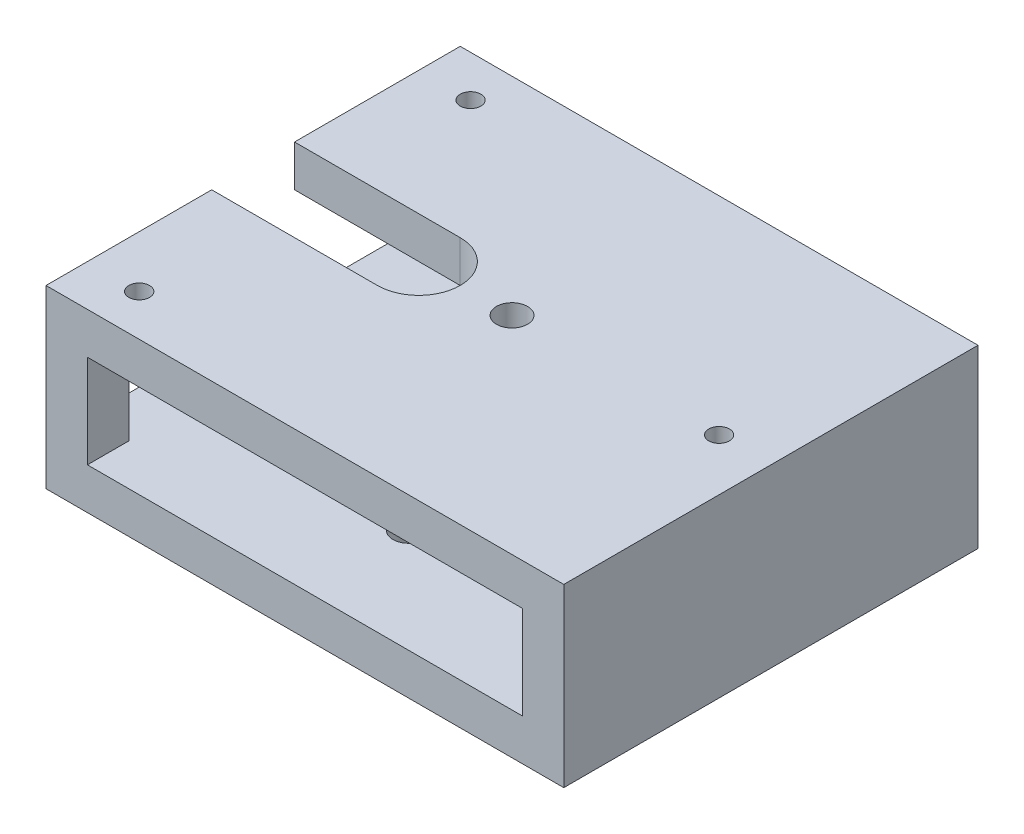
ISO-10303-21;
HEADER;
FILE_DESCRIPTION(('STEP AP214'),'2;1');
FILE_NAME('part.step','',(''),(''),'','','');
FILE_SCHEMA(('AUTOMOTIVE_DESIGN { 1 0 10303 214 1 1 1 1 }'));
ENDSEC;
DATA;
#1=APPLICATION_CONTEXT('core data for automotive mechanical design processes');
#2=APPLICATION_PROTOCOL_DEFINITION('international standard','automotive_design',2000,#1);
#3=PRODUCT_CONTEXT('',#1,'mechanical');
#4=PRODUCT('Part','Part','',(#3));
#5=PRODUCT_RELATED_PRODUCT_CATEGORY('part','',(#4));
#6=PRODUCT_DEFINITION_FORMATION('','',#4);
#7=PRODUCT_DEFINITION_CONTEXT('part definition',#1,'design');
#8=PRODUCT_DEFINITION('design','',#6,#7);
#9=PRODUCT_DEFINITION_SHAPE('','',#8);
#10=(LENGTH_UNIT() NAMED_UNIT(*) SI_UNIT(.MILLI.,.METRE.));
#11=(NAMED_UNIT(*) PLANE_ANGLE_UNIT() SI_UNIT($,.RADIAN.));
#12=(NAMED_UNIT(*) SI_UNIT($,.STERADIAN.) SOLID_ANGLE_UNIT());
#13=UNCERTAINTY_MEASURE_WITH_UNIT(LENGTH_MEASURE(1.E-05),#10,'distance_accuracy_value','');
#14=(GEOMETRIC_REPRESENTATION_CONTEXT(3) GLOBAL_UNCERTAINTY_ASSIGNED_CONTEXT((#13)) GLOBAL_UNIT_ASSIGNED_CONTEXT((#10,
#11,#12)) REPRESENTATION_CONTEXT('',''));
#15=CARTESIAN_POINT('',(0.,0.,0.));
#16=DIRECTION('',(0.,0.,1.));
#17=DIRECTION('',(1.,0.,0.));
#18=AXIS2_PLACEMENT_3D('',#15,#16,#17);
#19=CARTESIAN_POINT('',(-125.,20.,-100.));
#20=DIRECTION('',(1.,0.,0.));
#21=DIRECTION('',(0.,0.,-1.));
#22=AXIS2_PLACEMENT_3D('',#19,#20,#21);
#23=PLANE('',#22);
#24=DIRECTION('',(0.,0.,1.));
#25=VECTOR('',#24,1.);
#26=CARTESIAN_POINT('',(-125.,0.,-100.));
#27=LINE('',#26,#25);
#28=CARTESIAN_POINT('',(-125.,0.,-100.));
#29=VERTEX_POINT('',#28);
#30=CARTESIAN_POINT('',(-125.,0.,-20.));
#31=VERTEX_POINT('',#30);
#32=EDGE_CURVE('E328',#29,#31,#27,.T.);
#33=ORIENTED_EDGE('',*,*,#32,.T.);
#34=DIRECTION('',(0.,1.,0.));
#35=VECTOR('',#34,1.);
#36=CARTESIAN_POINT('',(-125.,0.,-20.));
#37=LINE('',#36,#35);
#38=CARTESIAN_POINT('',(-125.,20.,-20.));
#39=VERTEX_POINT('',#38);
#40=EDGE_CURVE('E365',#31,#39,#37,.T.);
#41=ORIENTED_EDGE('',*,*,#40,.T.);
#42=DIRECTION('',(0.,0.,1.));
#43=VECTOR('',#42,1.);
#44=CARTESIAN_POINT('',(-125.,20.,-100.));
#45=LINE('',#44,#43);
#46=CARTESIAN_POINT('',(-125.,20.,-80.));
#47=VERTEX_POINT('',#46);
#48=EDGE_CURVE('E318',#47,#39,#45,.T.);
#49=ORIENTED_EDGE('',*,*,#48,.F.);
#50=DIRECTION('',(0.,-1.,0.));
#51=VECTOR('',#50,1.);
#52=CARTESIAN_POINT('',(-125.,65.,-80.));
#53=LINE('',#52,#51);
#54=CARTESIAN_POINT('',(-125.,65.,-80.));
#55=VERTEX_POINT('',#54);
#56=EDGE_CURVE('E267',#55,#47,#53,.T.);
#57=ORIENTED_EDGE('',*,*,#56,.F.);
#58=DIRECTION('',(0.,0.,1.));
#59=VECTOR('',#58,1.);
#60=CARTESIAN_POINT('',(-125.,65.,-100.));
#61=LINE('',#60,#59);
#62=CARTESIAN_POINT('',(-125.,65.,-20.));
#63=VERTEX_POINT('',#62);
#64=EDGE_CURVE('E288',#55,#63,#61,.T.);
#65=ORIENTED_EDGE('',*,*,#64,.T.);
#66=CARTESIAN_POINT('',(-125.,85.,-20.));
#67=VERTEX_POINT('',#66);
#68=EDGE_CURVE('E360',#63,#67,#37,.T.);
#69=ORIENTED_EDGE('',*,*,#68,.T.);
#70=DIRECTION('',(0.,0.,1.));
#71=VECTOR('',#70,1.);
#72=CARTESIAN_POINT('',(-125.,85.,-100.));
#73=LINE('',#72,#71);
#74=CARTESIAN_POINT('',(-125.,85.,-100.));
#75=VERTEX_POINT('',#74);
#76=EDGE_CURVE('E279',#75,#67,#73,.T.);
#77=ORIENTED_EDGE('',*,*,#76,.F.);
#78=DIRECTION('',(0.,-1.,0.));
#79=VECTOR('',#78,1.);
#80=CARTESIAN_POINT('',(-125.,20.,-100.));
#81=LINE('',#80,#79);
#82=EDGE_CURVE('E337',#75,#29,#81,.T.);
#83=ORIENTED_EDGE('',*,*,#82,.T.);
#84=EDGE_LOOP('',(#33,#41,#49,#57,#65,#69,#77,#83));
#85=FACE_BOUND('',#84,.T.);
#86=ADVANCED_FACE('F38',(#85),#23,.F.);
#87=CARTESIAN_POINT('',(0.,20.,0.));
#88=DIRECTION('',(0.,1.,0.));
#89=DIRECTION('',(0.,0.,1.));
#90=AXIS2_PLACEMENT_3D('',#87,#88,#89);
#91=PLANE('',#90);
#92=DIRECTION('',(0.,0.,-1.));
#93=VECTOR('',#92,1.);
#94=CARTESIAN_POINT('',(120.,20.,80.));
#95=LINE('',#94,#93);
#96=CARTESIAN_POINT('',(120.,20.,80.));
#97=VERTEX_POINT('',#96);
#98=CARTESIAN_POINT('',(120.,20.,-80.));
#99=VERTEX_POINT('',#98);
#100=EDGE_CURVE('E53',#97,#99,#95,.T.);
#101=ORIENTED_EDGE('',*,*,#100,.T.);
#102=DIRECTION('',(1.,0.,0.));
#103=VECTOR('',#102,1.);
#104=CARTESIAN_POINT('',(125.,20.,-80.));
#105=LINE('',#104,#103);
#106=CARTESIAN_POINT('',(105.,20.,-80.));
#107=VERTEX_POINT('',#106);
#108=EDGE_CURVE('E231',#107,#99,#105,.T.);
#109=ORIENTED_EDGE('',*,*,#108,.F.);
#110=DIRECTION('',(0.,0.,1.));
#111=VECTOR('',#110,1.);
#112=CARTESIAN_POINT('',(105.,20.,-100.));
#113=LINE('',#112,#111);
#114=CARTESIAN_POINT('',(105.,20.,-100.));
#115=VERTEX_POINT('',#114);
#116=EDGE_CURVE('E227',#115,#107,#113,.T.);
#117=ORIENTED_EDGE('',*,*,#116,.F.);
#118=DIRECTION('',(-1.,0.,0.));
#119=VECTOR('',#118,1.);
#120=CARTESIAN_POINT('',(-125.,20.,-100.));
#121=LINE('',#120,#119);
#122=CARTESIAN_POINT('',(-105.,20.,-100.));
#123=VERTEX_POINT('',#122);
#124=EDGE_CURVE('E314',#115,#123,#121,.T.);
#125=ORIENTED_EDGE('',*,*,#124,.T.);
#126=DIRECTION('',(0.,0.,-1.));
#127=VECTOR('',#126,1.);
#128=CARTESIAN_POINT('',(-105.,20.,-100.));
#129=LINE('',#128,#127);
#130=CARTESIAN_POINT('',(-105.,20.,-80.));
#131=VERTEX_POINT('',#130);
#132=EDGE_CURVE('E254',#131,#123,#129,.T.);
#133=ORIENTED_EDGE('',*,*,#132,.F.);
#134=DIRECTION('',(1.,0.,0.));
#135=VECTOR('',#134,1.);
#136=CARTESIAN_POINT('',(-125.,20.,-80.));
#137=LINE('',#136,#135);
#138=EDGE_CURVE('E249',#47,#131,#137,.T.);
#139=ORIENTED_EDGE('',*,*,#138,.F.);
#140=ORIENTED_EDGE('',*,*,#48,.T.);
#141=DIRECTION('',(-1.,0.,0.));
#142=VECTOR('',#141,1.);
#143=CARTESIAN_POINT('',(0.,20.,-20.));
#144=LINE('',#143,#142);
#145=CARTESIAN_POINT('',(-45.0000000000001,20.,-20.));
#146=VERTEX_POINT('',#145);
#147=EDGE_CURVE('E395',#146,#39,#144,.T.);
#148=ORIENTED_EDGE('',*,*,#147,.F.);
#149=CARTESIAN_POINT('',(-45.0000000000001,20.,0.));
#150=DIRECTION('',(0.,1.,0.));
#151=DIRECTION('',(0.,0.,1.));
#152=AXIS2_PLACEMENT_3D('',#149,#150,#151);
#153=CIRCLE('',#152,20.);
#154=CARTESIAN_POINT('',(-45.,20.,20.));
#155=VERTEX_POINT('',#154);
#156=EDGE_CURVE('E391',#155,#146,#153,.T.);
#157=ORIENTED_EDGE('',*,*,#156,.F.);
#158=DIRECTION('',(1.,0.,0.));
#159=VECTOR('',#158,1.);
#160=CARTESIAN_POINT('',(0.,20.,20.));
#161=LINE('',#160,#159);
#162=CARTESIAN_POINT('',(-125.,20.,20.));
#163=VERTEX_POINT('',#162);
#164=EDGE_CURVE('E387',#163,#155,#161,.T.);
#165=ORIENTED_EDGE('',*,*,#164,.F.);
#166=CARTESIAN_POINT('',(-125.,20.,80.));
#167=VERTEX_POINT('',#166);
#168=EDGE_CURVE('E316',#163,#167,#45,.T.);
#169=ORIENTED_EDGE('',*,*,#168,.T.);
#170=DIRECTION('',(-1.,0.,0.));
#171=VECTOR('',#170,1.);
#172=CARTESIAN_POINT('',(-125.,20.,80.));
#173=LINE('',#172,#171);
#174=CARTESIAN_POINT('',(-105.,20.,80.));
#175=VERTEX_POINT('',#174);
#176=EDGE_CURVE('E297',#175,#167,#173,.T.);
#177=ORIENTED_EDGE('',*,*,#176,.F.);
#178=DIRECTION('',(0.,0.,-1.));
#179=VECTOR('',#178,1.);
#180=CARTESIAN_POINT('',(-105.,20.,100.));
#181=LINE('',#180,#179);
#182=CARTESIAN_POINT('',(-105.,20.,100.));
#183=VERTEX_POINT('',#182);
#184=EDGE_CURVE('E285',#183,#175,#181,.T.);
#185=ORIENTED_EDGE('',*,*,#184,.F.);
#186=DIRECTION('',(1.,0.,0.));
#187=VECTOR('',#186,1.);
#188=CARTESIAN_POINT('',(-125.,20.,100.));
#189=LINE('',#188,#187);
#190=CARTESIAN_POINT('',(105.,20.,100.));
#191=VERTEX_POINT('',#190);
#192=EDGE_CURVE('E219',#183,#191,#189,.T.);
#193=ORIENTED_EDGE('',*,*,#192,.T.);
#194=DIRECTION('',(0.,0.,1.));
#195=VECTOR('',#194,1.);
#196=CARTESIAN_POINT('',(105.,20.,100.));
#197=LINE('',#196,#195);
#198=CARTESIAN_POINT('',(105.,20.,80.));
#199=VERTEX_POINT('',#198);
#200=EDGE_CURVE('E212',#199,#191,#197,.T.);
#201=ORIENTED_EDGE('',*,*,#200,.F.);
#202=DIRECTION('',(-1.,0.,0.));
#203=VECTOR('',#202,1.);
#204=CARTESIAN_POINT('',(125.,20.,80.));
#205=LINE('',#204,#203);
#206=EDGE_CURVE('E203',#97,#199,#205,.T.);
#207=ORIENTED_EDGE('',*,*,#206,.F.);
#208=EDGE_LOOP('',(#101,#109,#117,#125,#133,#139,#140,#148,#157,#165,#169,#177,#185,#193,#201,#207));
#209=FACE_BOUND('',#208,.T.);
#210=CARTESIAN_POINT('',(0.,20.,50.));
#211=DIRECTION('',(0.,1.,0.));
#212=DIRECTION('',(0.,0.,1.));
#213=AXIS2_PLACEMENT_3D('',#210,#211,#212);
#214=CIRCLE('',#213,7.5);
#215=CARTESIAN_POINT('',(0.,20.,57.5));
#216=VERTEX_POINT('',#215);
#217=EDGE_CURVE('E451',#216,#216,#214,.F.);
#218=ORIENTED_EDGE('',*,*,#217,.T.);
#219=EDGE_LOOP('',(#218));
#220=FACE_BOUND('',#219,.T.);
#221=CARTESIAN_POINT('',(0.,20.,0.));
#222=DIRECTION('',(0.,1.,0.));
#223=DIRECTION('',(0.,0.,1.));
#224=AXIS2_PLACEMENT_3D('',#221,#222,#223);
#225=CIRCLE('',#224,7.5);
#226=CARTESIAN_POINT('',(0.,20.,7.5));
#227=VERTEX_POINT('',#226);
#228=EDGE_CURVE('E406',#227,#227,#225,.T.);
#229=ORIENTED_EDGE('',*,*,#228,.F.);
#230=EDGE_LOOP('',(#229));
#231=FACE_BOUND('',#230,.T.);
#232=ADVANCED_FACE('F216',(#209,#220,#231),#91,.T.);
#233=CARTESIAN_POINT('',(0.,65.,0.));
#234=DIRECTION('',(0.,1.,0.));
#235=DIRECTION('',(0.,0.,1.));
#236=AXIS2_PLACEMENT_3D('',#233,#234,#235);
#237=PLANE('',#236);
#238=CARTESIAN_POINT('',(0.,65.,0.));
#239=DIRECTION('',(0.,1.,0.));
#240=DIRECTION('',(0.,0.,1.));
#241=AXIS2_PLACEMENT_3D('',#238,#239,#240);
#242=CIRCLE('',#241,7.5);
#243=CARTESIAN_POINT('',(0.,65.,7.5));
#244=VERTEX_POINT('',#243);
#245=EDGE_CURVE('E401',#244,#244,#242,.T.);
#246=ORIENTED_EDGE('',*,*,#245,.T.);
#247=EDGE_LOOP('',(#246));
#248=FACE_BOUND('',#247,.T.);
#249=DIRECTION('',(1.,0.,0.));
#250=VECTOR('',#249,1.);
#251=CARTESIAN_POINT('',(125.,65.,-80.));
#252=LINE('',#251,#250);
#253=CARTESIAN_POINT('',(105.,65.,-80.));
#254=VERTEX_POINT('',#253);
#255=CARTESIAN_POINT('',(120.,65.,-80.));
#256=VERTEX_POINT('',#255);
#257=EDGE_CURVE('E238',#254,#256,#252,.T.);
#258=ORIENTED_EDGE('',*,*,#257,.T.);
#259=DIRECTION('',(0.,0.,1.));
#260=VECTOR('',#259,1.);
#261=CARTESIAN_POINT('',(120.,65.,80.));
#262=LINE('',#261,#260);
#263=CARTESIAN_POINT('',(120.,65.,80.));
#264=VERTEX_POINT('',#263);
#265=EDGE_CURVE('E464',#256,#264,#262,.T.);
#266=ORIENTED_EDGE('',*,*,#265,.T.);
#267=DIRECTION('',(-1.,0.,0.));
#268=VECTOR('',#267,1.);
#269=CARTESIAN_POINT('',(125.,65.,80.));
#270=LINE('',#269,#268);
#271=CARTESIAN_POINT('',(105.,65.,80.));
#272=VERTEX_POINT('',#271);
#273=EDGE_CURVE('E222',#264,#272,#270,.T.);
#274=ORIENTED_EDGE('',*,*,#273,.T.);
#275=DIRECTION('',(0.,0.,1.));
#276=VECTOR('',#275,1.);
#277=CARTESIAN_POINT('',(105.,65.,100.));
#278=LINE('',#277,#276);
#279=CARTESIAN_POINT('',(105.,65.,100.));
#280=VERTEX_POINT('',#279);
#281=EDGE_CURVE('E226',#272,#280,#278,.T.);
#282=ORIENTED_EDGE('',*,*,#281,.T.);
#283=DIRECTION('',(1.,0.,0.));
#284=VECTOR('',#283,1.);
#285=CARTESIAN_POINT('',(-125.,65.,100.));
#286=LINE('',#285,#284);
#287=CARTESIAN_POINT('',(-105.,65.,100.));
#288=VERTEX_POINT('',#287);
#289=EDGE_CURVE('E275',#288,#280,#286,.T.);
#290=ORIENTED_EDGE('',*,*,#289,.F.);
#291=DIRECTION('',(0.,0.,-1.));
#292=VECTOR('',#291,1.);
#293=CARTESIAN_POINT('',(-105.,65.,100.));
#294=LINE('',#293,#292);
#295=CARTESIAN_POINT('',(-105.,65.,80.));
#296=VERTEX_POINT('',#295);
#297=EDGE_CURVE('E293',#288,#296,#294,.T.);
#298=ORIENTED_EDGE('',*,*,#297,.T.);
#299=DIRECTION('',(-1.,0.,0.));
#300=VECTOR('',#299,1.);
#301=CARTESIAN_POINT('',(-125.,65.,80.));
#302=LINE('',#301,#300);
#303=CARTESIAN_POINT('',(-125.,65.,80.));
#304=VERTEX_POINT('',#303);
#305=EDGE_CURVE('E296',#296,#304,#302,.T.);
#306=ORIENTED_EDGE('',*,*,#305,.T.);
#307=CARTESIAN_POINT('',(-125.,65.,20.));
#308=VERTEX_POINT('',#307);
#309=EDGE_CURVE('E287',#308,#304,#61,.T.);
#310=ORIENTED_EDGE('',*,*,#309,.F.);
#311=DIRECTION('',(1.,0.,0.));
#312=VECTOR('',#311,1.);
#313=CARTESIAN_POINT('',(0.,65.,20.));
#314=LINE('',#313,#312);
#315=CARTESIAN_POINT('',(-45.,65.,20.));
#316=VERTEX_POINT('',#315);
#317=EDGE_CURVE('E369',#308,#316,#314,.T.);
#318=ORIENTED_EDGE('',*,*,#317,.T.);
#319=CARTESIAN_POINT('',(-45.0000000000001,65.,0.));
#320=DIRECTION('',(0.,1.,0.));
#321=DIRECTION('',(0.,0.,1.));
#322=AXIS2_PLACEMENT_3D('',#319,#320,#321);
#323=CIRCLE('',#322,20.);
#324=CARTESIAN_POINT('',(-45.0000000000001,65.,-20.));
#325=VERTEX_POINT('',#324);
#326=EDGE_CURVE('E389',#316,#325,#323,.T.);
#327=ORIENTED_EDGE('',*,*,#326,.T.);
#328=DIRECTION('',(-1.,0.,0.));
#329=VECTOR('',#328,1.);
#330=CARTESIAN_POINT('',(0.,65.,-20.));
#331=LINE('',#330,#329);
#332=EDGE_CURVE('E393',#325,#63,#331,.T.);
#333=ORIENTED_EDGE('',*,*,#332,.T.);
#334=ORIENTED_EDGE('',*,*,#64,.F.);
#335=DIRECTION('',(1.,0.,0.));
#336=VECTOR('',#335,1.);
#337=CARTESIAN_POINT('',(-125.,65.,-80.));
#338=LINE('',#337,#336);
#339=CARTESIAN_POINT('',(-105.,65.,-80.));
#340=VERTEX_POINT('',#339);
#341=EDGE_CURVE('E250',#55,#340,#338,.T.);
#342=ORIENTED_EDGE('',*,*,#341,.T.);
#343=DIRECTION('',(0.,0.,-1.));
#344=VECTOR('',#343,1.);
#345=CARTESIAN_POINT('',(-105.,65.,-100.));
#346=LINE('',#345,#344);
#347=CARTESIAN_POINT('',(-105.,65.,-100.));
#348=VERTEX_POINT('',#347);
#349=EDGE_CURVE('E253',#340,#348,#346,.T.);
#350=ORIENTED_EDGE('',*,*,#349,.T.);
#351=DIRECTION('',(-1.,0.,0.));
#352=VECTOR('',#351,1.);
#353=CARTESIAN_POINT('',(-125.,65.,-100.));
#354=LINE('',#353,#352);
#355=CARTESIAN_POINT('',(105.,65.,-100.));
#356=VERTEX_POINT('',#355);
#357=EDGE_CURVE('E270',#356,#348,#354,.T.);
#358=ORIENTED_EDGE('',*,*,#357,.F.);
#359=DIRECTION('',(0.,0.,1.));
#360=VECTOR('',#359,1.);
#361=CARTESIAN_POINT('',(105.,65.,-100.));
#362=LINE('',#361,#360);
#363=EDGE_CURVE('E235',#356,#254,#362,.T.);
#364=ORIENTED_EDGE('',*,*,#363,.T.);
#365=EDGE_LOOP('',(#258,#266,#274,#282,#290,#298,#306,#310,#318,#327,#333,#334,#342,#350,#358,#364));
#366=FACE_BOUND('',#365,.T.);
#367=ADVANCED_FACE('F429',(#248,#366),#237,.F.);
#368=CARTESIAN_POINT('',(125.,20.,-100.));
#369=DIRECTION('',(-1.,0.,0.));
#370=DIRECTION('',(0.,0.,1.));
#371=AXIS2_PLACEMENT_3D('',#368,#369,#370);
#372=PLANE('',#371);
#373=DIRECTION('',(0.,0.,-1.));
#374=VECTOR('',#373,1.);
#375=CARTESIAN_POINT('',(125.,0.,-100.));
#376=LINE('',#375,#374);
#377=CARTESIAN_POINT('',(125.,0.,100.));
#378=VERTEX_POINT('',#377);
#379=CARTESIAN_POINT('',(125.,0.,-100.));
#380=VERTEX_POINT('',#379);
#381=EDGE_CURVE('E313',#378,#380,#376,.T.);
#382=ORIENTED_EDGE('',*,*,#381,.T.);
#383=DIRECTION('',(0.,-1.,0.));
#384=VECTOR('',#383,1.);
#385=CARTESIAN_POINT('',(125.,20.,-100.));
#386=LINE('',#385,#384);
#387=CARTESIAN_POINT('',(125.,85.,-100.));
#388=VERTEX_POINT('',#387);
#389=EDGE_CURVE('E340',#388,#380,#386,.T.);
#390=ORIENTED_EDGE('',*,*,#389,.F.);
#391=DIRECTION('',(0.,0.,-1.));
#392=VECTOR('',#391,1.);
#393=CARTESIAN_POINT('',(125.,85.,-100.));
#394=LINE('',#393,#392);
#395=CARTESIAN_POINT('',(125.,85.,100.));
#396=VERTEX_POINT('',#395);
#397=EDGE_CURVE('E271',#396,#388,#394,.T.);
#398=ORIENTED_EDGE('',*,*,#397,.F.);
#399=DIRECTION('',(0.,-1.,0.));
#400=VECTOR('',#399,1.);
#401=CARTESIAN_POINT('',(125.,20.,100.));
#402=LINE('',#401,#400);
#403=EDGE_CURVE('E322',#396,#378,#402,.T.);
#404=ORIENTED_EDGE('',*,*,#403,.T.);
#405=EDGE_LOOP('',(#382,#390,#398,#404));
#406=FACE_BOUND('',#405,.T.);
#407=ADVANCED_FACE('F40',(#406),#372,.F.);
#408=CARTESIAN_POINT('',(-125.,20.,-100.));
#409=DIRECTION('',(0.,0.,1.));
#410=DIRECTION('',(1.,0.,0.));
#411=AXIS2_PLACEMENT_3D('',#408,#409,#410);
#412=PLANE('',#411);
#413=DIRECTION('',(0.,-1.,0.));
#414=VECTOR('',#413,1.);
#415=CARTESIAN_POINT('',(105.,65.,-100.));
#416=LINE('',#415,#414);
#417=EDGE_CURVE('E246',#356,#115,#416,.T.);
#418=ORIENTED_EDGE('',*,*,#417,.F.);
#419=ORIENTED_EDGE('',*,*,#357,.T.);
#420=DIRECTION('',(0.,-1.,0.));
#421=VECTOR('',#420,1.);
#422=CARTESIAN_POINT('',(-105.,65.,-100.));
#423=LINE('',#422,#421);
#424=EDGE_CURVE('E257',#348,#123,#423,.T.);
#425=ORIENTED_EDGE('',*,*,#424,.T.);
#426=ORIENTED_EDGE('',*,*,#124,.F.);
#427=EDGE_LOOP('',(#418,#419,#425,#426));
#428=FACE_BOUND('',#427,.T.);
#429=DIRECTION('',(-1.,0.,0.));
#430=VECTOR('',#429,1.);
#431=CARTESIAN_POINT('',(-125.,0.,-100.));
#432=LINE('',#431,#430);
#433=EDGE_CURVE('E325',#380,#29,#432,.T.);
#434=ORIENTED_EDGE('',*,*,#433,.T.);
#435=ORIENTED_EDGE('',*,*,#82,.F.);
#436=DIRECTION('',(-1.,0.,0.));
#437=VECTOR('',#436,1.);
#438=CARTESIAN_POINT('',(-125.,85.,-100.));
#439=LINE('',#438,#437);
#440=EDGE_CURVE('E274',#388,#75,#439,.T.);
#441=ORIENTED_EDGE('',*,*,#440,.F.);
#442=ORIENTED_EDGE('',*,*,#389,.T.);
#443=EDGE_LOOP('',(#434,#435,#441,#442));
#444=FACE_BOUND('',#443,.T.);
#445=ADVANCED_FACE('F479',(#428,#444),#412,.F.);
#446=CARTESIAN_POINT('',(-125.,85.,20.));
#447=VERTEX_POINT('',#446);
#448=CARTESIAN_POINT('',(-125.,85.,100.));
#449=VERTEX_POINT('',#448);
#450=EDGE_CURVE('E278',#447,#449,#73,.T.);
#451=ORIENTED_EDGE('',*,*,#450,.F.);
#452=DIRECTION('',(0.,1.,0.));
#453=VECTOR('',#452,1.);
#454=CARTESIAN_POINT('',(-125.,0.,20.));
#455=LINE('',#454,#453);
#456=EDGE_CURVE('E378',#308,#447,#455,.T.);
#457=ORIENTED_EDGE('',*,*,#456,.F.);
#458=ORIENTED_EDGE('',*,*,#309,.T.);
#459=DIRECTION('',(0.,-1.,0.));
#460=VECTOR('',#459,1.);
#461=CARTESIAN_POINT('',(-125.,65.,80.));
#462=LINE('',#461,#460);
#463=EDGE_CURVE('E300',#304,#167,#462,.T.);
#464=ORIENTED_EDGE('',*,*,#463,.T.);
#465=ORIENTED_EDGE('',*,*,#168,.F.);
#466=CARTESIAN_POINT('',(-125.,0.,20.));
#467=VERTEX_POINT('',#466);
#468=EDGE_CURVE('E376',#467,#163,#455,.T.);
#469=ORIENTED_EDGE('',*,*,#468,.F.);
#470=CARTESIAN_POINT('',(-125.,0.,100.));
#471=VERTEX_POINT('',#470);
#472=EDGE_CURVE('E327',#467,#471,#27,.T.);
#473=ORIENTED_EDGE('',*,*,#472,.T.);
#474=DIRECTION('',(0.,-1.,0.));
#475=VECTOR('',#474,1.);
#476=CARTESIAN_POINT('',(-125.,20.,100.));
#477=LINE('',#476,#475);
#478=EDGE_CURVE('E334',#449,#471,#477,.T.);
#479=ORIENTED_EDGE('',*,*,#478,.F.);
#480=EDGE_LOOP('',(#451,#457,#458,#464,#465,#469,#473,#479));
#481=FACE_BOUND('',#480,.T.);
#482=ADVANCED_FACE('F444',(#481),#23,.F.);
#483=CARTESIAN_POINT('',(-125.,20.,100.));
#484=DIRECTION('',(0.,0.,-1.));
#485=DIRECTION('',(-1.,0.,0.));
#486=AXIS2_PLACEMENT_3D('',#483,#484,#485);
#487=PLANE('',#486);
#488=ORIENTED_EDGE('',*,*,#403,.F.);
#489=DIRECTION('',(1.,0.,0.));
#490=VECTOR('',#489,1.);
#491=CARTESIAN_POINT('',(-125.,85.,100.));
#492=LINE('',#491,#490);
#493=EDGE_CURVE('E282',#449,#396,#492,.T.);
#494=ORIENTED_EDGE('',*,*,#493,.F.);
#495=ORIENTED_EDGE('',*,*,#478,.T.);
#496=DIRECTION('',(1.,0.,0.));
#497=VECTOR('',#496,1.);
#498=CARTESIAN_POINT('',(-125.,0.,100.));
#499=LINE('',#498,#497);
#500=EDGE_CURVE('E317',#471,#378,#499,.T.);
#501=ORIENTED_EDGE('',*,*,#500,.T.);
#502=EDGE_LOOP('',(#488,#494,#495,#501));
#503=FACE_BOUND('',#502,.T.);
#504=ORIENTED_EDGE('',*,*,#289,.T.);
#505=DIRECTION('',(0.,-1.,0.));
#506=VECTOR('',#505,1.);
#507=CARTESIAN_POINT('',(105.,65.,100.));
#508=LINE('',#507,#506);
#509=EDGE_CURVE('E228',#280,#191,#508,.T.);
#510=ORIENTED_EDGE('',*,*,#509,.T.);
#511=ORIENTED_EDGE('',*,*,#192,.F.);
#512=DIRECTION('',(0.,-1.,0.));
#513=VECTOR('',#512,1.);
#514=CARTESIAN_POINT('',(-105.,65.,100.));
#515=LINE('',#514,#513);
#516=EDGE_CURVE('E310',#288,#183,#515,.T.);
#517=ORIENTED_EDGE('',*,*,#516,.F.);
#518=EDGE_LOOP('',(#504,#510,#511,#517));
#519=FACE_BOUND('',#518,.T.);
#520=ADVANCED_FACE('F432',(#503,#519),#487,.F.);
#521=CARTESIAN_POINT('',(0.,0.,0.));
#522=DIRECTION('',(0.,1.,0.));
#523=DIRECTION('',(0.,0.,1.));
#524=AXIS2_PLACEMENT_3D('',#521,#522,#523);
#525=PLANE('',#524);
#526=CARTESIAN_POINT('',(0.,0.,50.));
#527=DIRECTION('',(0.,-1.,0.));
#528=DIRECTION('',(0.,0.,-1.));
#529=AXIS2_PLACEMENT_3D('',#526,#527,#528);
#530=CIRCLE('',#529,7.5);
#531=CARTESIAN_POINT('',(0.,0.,42.5));
#532=VERTEX_POINT('',#531);
#533=EDGE_CURVE('E456',#532,#532,#530,.T.);
#534=ORIENTED_EDGE('',*,*,#533,.F.);
#535=EDGE_LOOP('',(#534));
#536=FACE_BOUND('',#535,.T.);
#537=CARTESIAN_POINT('',(-45.0000000000001,0.,0.));
#538=DIRECTION('',(0.,1.,0.));
#539=DIRECTION('',(0.,0.,-1.));
#540=AXIS2_PLACEMENT_3D('',#537,#538,#539);
#541=CIRCLE('',#540,20.);
#542=CARTESIAN_POINT('',(-45.,0.,20.));
#543=VERTEX_POINT('',#542);
#544=CARTESIAN_POINT('',(-45.0000000000001,0.,-20.));
#545=VERTEX_POINT('',#544);
#546=EDGE_CURVE('E62',#543,#545,#541,.T.);
#547=ORIENTED_EDGE('',*,*,#546,.T.);
#548=DIRECTION('',(-1.,0.,0.));
#549=VECTOR('',#548,1.);
#550=CARTESIAN_POINT('',(-125.,0.,-20.));
#551=LINE('',#550,#549);
#552=EDGE_CURVE('E374',#545,#31,#551,.T.);
#553=ORIENTED_EDGE('',*,*,#552,.T.);
#554=ORIENTED_EDGE('',*,*,#32,.F.);
#555=ORIENTED_EDGE('',*,*,#433,.F.);
#556=ORIENTED_EDGE('',*,*,#381,.F.);
#557=ORIENTED_EDGE('',*,*,#500,.F.);
#558=ORIENTED_EDGE('',*,*,#472,.F.);
#559=DIRECTION('',(1.,0.,0.));
#560=VECTOR('',#559,1.);
#561=CARTESIAN_POINT('',(-125.,0.,20.));
#562=LINE('',#561,#560);
#563=EDGE_CURVE('E86',#467,#543,#562,.T.);
#564=ORIENTED_EDGE('',*,*,#563,.T.);
#565=EDGE_LOOP('',(#547,#553,#554,#555,#556,#557,#558,#564));
#566=FACE_BOUND('',#565,.T.);
#567=ADVANCED_FACE('F496',(#536,#566),#525,.F.);
#568=CARTESIAN_POINT('',(-105.,65.,100.));
#569=DIRECTION('',(-1.,0.,0.));
#570=DIRECTION('',(0.,0.,1.));
#571=AXIS2_PLACEMENT_3D('',#568,#569,#570);
#572=PLANE('',#571);
#573=ORIENTED_EDGE('',*,*,#184,.T.);
#574=DIRECTION('',(0.,-1.,0.));
#575=VECTOR('',#574,1.);
#576=CARTESIAN_POINT('',(-105.,65.,80.));
#577=LINE('',#576,#575);
#578=EDGE_CURVE('E307',#296,#175,#577,.T.);
#579=ORIENTED_EDGE('',*,*,#578,.F.);
#580=ORIENTED_EDGE('',*,*,#297,.F.);
#581=ORIENTED_EDGE('',*,*,#516,.T.);
#582=EDGE_LOOP('',(#573,#579,#580,#581));
#583=FACE_BOUND('',#582,.T.);
#584=ADVANCED_FACE('F435',(#583),#572,.F.);
#585=CARTESIAN_POINT('',(-125.,65.,80.));
#586=DIRECTION('',(0.,0.,1.));
#587=DIRECTION('',(1.,0.,0.));
#588=AXIS2_PLACEMENT_3D('',#585,#586,#587);
#589=PLANE('',#588);
#590=ORIENTED_EDGE('',*,*,#176,.T.);
#591=ORIENTED_EDGE('',*,*,#463,.F.);
#592=ORIENTED_EDGE('',*,*,#305,.F.);
#593=ORIENTED_EDGE('',*,*,#578,.T.);
#594=EDGE_LOOP('',(#590,#591,#592,#593));
#595=FACE_BOUND('',#594,.T.);
#596=ADVANCED_FACE('F440',(#595),#589,.F.);
#597=CARTESIAN_POINT('',(0.,85.,0.));
#598=DIRECTION('',(0.,1.,0.));
#599=DIRECTION('',(0.,0.,1.));
#600=AXIS2_PLACEMENT_3D('',#597,#598,#599);
#601=PLANE('',#600);
#602=DIRECTION('',(-1.,0.,0.));
#603=VECTOR('',#602,1.);
#604=CARTESIAN_POINT('',(0.,85.,-20.));
#605=LINE('',#604,#603);
#606=CARTESIAN_POINT('',(-45.0000000000001,85.,-20.));
#607=VERTEX_POINT('',#606);
#608=EDGE_CURVE('E11',#607,#67,#605,.T.);
#609=ORIENTED_EDGE('',*,*,#608,.F.);
#610=CARTESIAN_POINT('',(-45.0000000000001,85.,0.));
#611=DIRECTION('',(0.,1.,0.));
#612=DIRECTION('',(0.,0.,1.));
#613=AXIS2_PLACEMENT_3D('',#610,#611,#612);
#614=CIRCLE('',#613,20.);
#615=CARTESIAN_POINT('',(-45.,85.,20.));
#616=VERTEX_POINT('',#615);
#617=EDGE_CURVE('E42',#616,#607,#614,.T.);
#618=ORIENTED_EDGE('',*,*,#617,.F.);
#619=DIRECTION('',(1.,0.,0.));
#620=VECTOR('',#619,1.);
#621=CARTESIAN_POINT('',(0.,85.,20.));
#622=LINE('',#621,#620);
#623=EDGE_CURVE('E343',#447,#616,#622,.T.);
#624=ORIENTED_EDGE('',*,*,#623,.F.);
#625=ORIENTED_EDGE('',*,*,#450,.T.);
#626=ORIENTED_EDGE('',*,*,#493,.T.);
#627=ORIENTED_EDGE('',*,*,#397,.T.);
#628=ORIENTED_EDGE('',*,*,#440,.T.);
#629=ORIENTED_EDGE('',*,*,#76,.T.);
#630=EDGE_LOOP('',(#609,#618,#624,#625,#626,#627,#628,#629));
#631=FACE_BOUND('',#630,.T.);
#632=CARTESIAN_POINT('',(0.,85.,0.));
#633=DIRECTION('',(0.,1.,0.));
#634=DIRECTION('',(0.,0.,1.));
#635=AXIS2_PLACEMENT_3D('',#632,#633,#634);
#636=CIRCLE('',#635,7.5);
#637=CARTESIAN_POINT('',(0.,85.,7.5));
#638=VERTEX_POINT('',#637);
#639=EDGE_CURVE('E397',#638,#638,#636,.T.);
#640=ORIENTED_EDGE('',*,*,#639,.F.);
#641=EDGE_LOOP('',(#640));
#642=FACE_BOUND('',#641,.T.);
#643=CARTESIAN_POINT('',(99.9999999999999,85.,0.));
#644=DIRECTION('',(0.,1.,0.));
#645=DIRECTION('',(0.,0.,1.));
#646=AXIS2_PLACEMENT_3D('',#643,#644,#645);
#647=CIRCLE('',#646,5.);
#648=CARTESIAN_POINT('',(99.9999999999999,85.,5.));
#649=VERTEX_POINT('',#648);
#650=EDGE_CURVE('E412',#649,#649,#647,.T.);
#651=ORIENTED_EDGE('',*,*,#650,.F.);
#652=EDGE_LOOP('',(#651));
#653=FACE_BOUND('',#652,.T.);
#654=CARTESIAN_POINT('',(-100.,85.,80.));
#655=DIRECTION('',(0.,1.,0.));
#656=DIRECTION('',(0.,0.,1.));
#657=AXIS2_PLACEMENT_3D('',#654,#655,#656);
#658=CIRCLE('',#657,5.00000000000001);
#659=CARTESIAN_POINT('',(-100.,85.,85.));
#660=VERTEX_POINT('',#659);
#661=EDGE_CURVE('E418',#660,#660,#658,.T.);
#662=ORIENTED_EDGE('',*,*,#661,.F.);
#663=EDGE_LOOP('',(#662));
#664=FACE_BOUND('',#663,.T.);
#665=CARTESIAN_POINT('',(-100.,85.,-80.));
#666=DIRECTION('',(0.,1.,0.));
#667=DIRECTION('',(0.,0.,1.));
#668=AXIS2_PLACEMENT_3D('',#665,#666,#667);
#669=CIRCLE('',#668,5.00000000000001);
#670=CARTESIAN_POINT('',(-100.,85.,-75.));
#671=VERTEX_POINT('',#670);
#672=EDGE_CURVE('E409',#671,#671,#669,.T.);
#673=ORIENTED_EDGE('',*,*,#672,.F.);
#674=EDGE_LOOP('',(#673));
#675=FACE_BOUND('',#674,.T.);
#676=ADVANCED_FACE('F355',(#631,#642,#653,#664,#675),#601,.T.);
#677=CARTESIAN_POINT('',(-125.,65.,-80.));
#678=DIRECTION('',(0.,0.,-1.));
#679=DIRECTION('',(-1.,0.,0.));
#680=AXIS2_PLACEMENT_3D('',#677,#678,#679);
#681=PLANE('',#680);
#682=ORIENTED_EDGE('',*,*,#138,.T.);
#683=DIRECTION('',(0.,-1.,0.));
#684=VECTOR('',#683,1.);
#685=CARTESIAN_POINT('',(-105.,65.,-80.));
#686=LINE('',#685,#684);
#687=EDGE_CURVE('E264',#340,#131,#686,.T.);
#688=ORIENTED_EDGE('',*,*,#687,.F.);
#689=ORIENTED_EDGE('',*,*,#341,.F.);
#690=ORIENTED_EDGE('',*,*,#56,.T.);
#691=EDGE_LOOP('',(#682,#688,#689,#690));
#692=FACE_BOUND('',#691,.T.);
#693=ADVANCED_FACE('F486',(#692),#681,.F.);
#694=CARTESIAN_POINT('',(-105.,65.,-100.));
#695=DIRECTION('',(-1.,0.,0.));
#696=DIRECTION('',(0.,0.,1.));
#697=AXIS2_PLACEMENT_3D('',#694,#695,#696);
#698=PLANE('',#697);
#699=ORIENTED_EDGE('',*,*,#132,.T.);
#700=ORIENTED_EDGE('',*,*,#424,.F.);
#701=ORIENTED_EDGE('',*,*,#349,.F.);
#702=ORIENTED_EDGE('',*,*,#687,.T.);
#703=EDGE_LOOP('',(#699,#700,#701,#702));
#704=FACE_BOUND('',#703,.T.);
#705=ADVANCED_FACE('F483',(#704),#698,.F.);
#706=CARTESIAN_POINT('',(105.,65.,-100.));
#707=DIRECTION('',(1.,0.,0.));
#708=DIRECTION('',(0.,0.,-1.));
#709=AXIS2_PLACEMENT_3D('',#706,#707,#708);
#710=PLANE('',#709);
#711=ORIENTED_EDGE('',*,*,#116,.T.);
#712=DIRECTION('',(0.,-1.,0.));
#713=VECTOR('',#712,1.);
#714=CARTESIAN_POINT('',(105.,65.,-80.));
#715=LINE('',#714,#713);
#716=EDGE_CURVE('E240',#254,#107,#715,.T.);
#717=ORIENTED_EDGE('',*,*,#716,.F.);
#718=ORIENTED_EDGE('',*,*,#363,.F.);
#719=ORIENTED_EDGE('',*,*,#417,.T.);
#720=EDGE_LOOP('',(#711,#717,#718,#719));
#721=FACE_BOUND('',#720,.T.);
#722=ADVANCED_FACE('F475',(#721),#710,.F.);
#723=CARTESIAN_POINT('',(125.,65.,-80.));
#724=DIRECTION('',(0.,0.,-1.));
#725=DIRECTION('',(-1.,0.,0.));
#726=AXIS2_PLACEMENT_3D('',#723,#724,#725);
#727=PLANE('',#726);
#728=ORIENTED_EDGE('',*,*,#108,.T.);
#729=DIRECTION('',(0.,1.,0.));
#730=VECTOR('',#729,1.);
#731=CARTESIAN_POINT('',(120.,65.,-80.));
#732=LINE('',#731,#730);
#733=EDGE_CURVE('E459',#99,#256,#732,.T.);
#734=ORIENTED_EDGE('',*,*,#733,.T.);
#735=ORIENTED_EDGE('',*,*,#257,.F.);
#736=ORIENTED_EDGE('',*,*,#716,.T.);
#737=EDGE_LOOP('',(#728,#734,#735,#736));
#738=FACE_BOUND('',#737,.T.);
#739=ADVANCED_FACE('F472',(#738),#727,.F.);
#740=CARTESIAN_POINT('',(125.,65.,80.));
#741=DIRECTION('',(0.,0.,1.));
#742=DIRECTION('',(1.,0.,0.));
#743=AXIS2_PLACEMENT_3D('',#740,#741,#742);
#744=PLANE('',#743);
#745=ORIENTED_EDGE('',*,*,#273,.F.);
#746=DIRECTION('',(0.,-1.,0.));
#747=VECTOR('',#746,1.);
#748=CARTESIAN_POINT('',(120.,65.,80.));
#749=LINE('',#748,#747);
#750=EDGE_CURVE('E210',#264,#97,#749,.T.);
#751=ORIENTED_EDGE('',*,*,#750,.T.);
#752=ORIENTED_EDGE('',*,*,#206,.T.);
#753=DIRECTION('',(0.,-1.,0.));
#754=VECTOR('',#753,1.);
#755=CARTESIAN_POINT('',(105.,65.,80.));
#756=LINE('',#755,#754);
#757=EDGE_CURVE('E208',#272,#199,#756,.T.);
#758=ORIENTED_EDGE('',*,*,#757,.F.);
#759=EDGE_LOOP('',(#745,#751,#752,#758));
#760=FACE_BOUND('',#759,.T.);
#761=ADVANCED_FACE('F206',(#760),#744,.F.);
#762=CARTESIAN_POINT('',(105.,65.,100.));
#763=DIRECTION('',(1.,0.,0.));
#764=DIRECTION('',(0.,0.,-1.));
#765=AXIS2_PLACEMENT_3D('',#762,#763,#764);
#766=PLANE('',#765);
#767=ORIENTED_EDGE('',*,*,#200,.T.);
#768=ORIENTED_EDGE('',*,*,#509,.F.);
#769=ORIENTED_EDGE('',*,*,#281,.F.);
#770=ORIENTED_EDGE('',*,*,#757,.T.);
#771=EDGE_LOOP('',(#767,#768,#769,#770));
#772=FACE_BOUND('',#771,.T.);
#773=ADVANCED_FACE('F224',(#772),#766,.F.);
#774=CARTESIAN_POINT('',(-100.,75.,-80.));
#775=DIRECTION('',(0.,1.,0.));
#776=DIRECTION('',(0.,0.,1.));
#777=AXIS2_PLACEMENT_3D('',#774,#775,#776);
#778=CYLINDRICAL_SURFACE('',#777,5.00000000000001);
#779=CARTESIAN_POINT('',(-100.,75.,-80.));
#780=DIRECTION('',(0.,1.,0.));
#781=DIRECTION('',(0.,0.,1.));
#782=AXIS2_PLACEMENT_3D('',#779,#780,#781);
#783=CIRCLE('',#782,5.00000000000001);
#784=CARTESIAN_POINT('',(-100.,75.,-75.));
#785=VERTEX_POINT('',#784);
#786=EDGE_CURVE('E421',#785,#785,#783,.T.);
#787=ORIENTED_EDGE('',*,*,#786,.F.);
#788=EDGE_LOOP('',(#787));
#789=FACE_BOUND('',#788,.T.);
#790=ORIENTED_EDGE('',*,*,#672,.T.);
#791=EDGE_LOOP('',(#790));
#792=FACE_BOUND('',#791,.T.);
#793=ADVANCED_FACE('F542',(#789,#792),#778,.F.);
#794=CARTESIAN_POINT('',(-100.,75.,-80.));
#795=DIRECTION('',(0.,1.,0.));
#796=DIRECTION('',(0.,0.,1.));
#797=AXIS2_PLACEMENT_3D('',#794,#795,#796);
#798=PLANE('',#797);
#799=ORIENTED_EDGE('',*,*,#786,.T.);
#800=EDGE_LOOP('',(#799));
#801=FACE_BOUND('',#800,.T.);
#802=ADVANCED_FACE('F545',(#801),#798,.T.);
#803=CARTESIAN_POINT('',(-100.,75.,80.));
#804=DIRECTION('',(0.,1.,0.));
#805=DIRECTION('',(0.,0.,1.));
#806=AXIS2_PLACEMENT_3D('',#803,#804,#805);
#807=CYLINDRICAL_SURFACE('',#806,5.00000000000001);
#808=CARTESIAN_POINT('',(-100.,75.,80.));
#809=DIRECTION('',(0.,1.,0.));
#810=DIRECTION('',(0.,0.,1.));
#811=AXIS2_PLACEMENT_3D('',#808,#809,#810);
#812=CIRCLE('',#811,5.00000000000001);
#813=CARTESIAN_POINT('',(-100.,75.,85.));
#814=VERTEX_POINT('',#813);
#815=EDGE_CURVE('E415',#814,#814,#812,.T.);
#816=ORIENTED_EDGE('',*,*,#815,.F.);
#817=EDGE_LOOP('',(#816));
#818=FACE_BOUND('',#817,.T.);
#819=ORIENTED_EDGE('',*,*,#661,.T.);
#820=EDGE_LOOP('',(#819));
#821=FACE_BOUND('',#820,.T.);
#822=ADVANCED_FACE('F549',(#818,#821),#807,.F.);
#823=CARTESIAN_POINT('',(-100.,75.,80.));
#824=DIRECTION('',(0.,1.,0.));
#825=DIRECTION('',(0.,0.,1.));
#826=AXIS2_PLACEMENT_3D('',#823,#824,#825);
#827=PLANE('',#826);
#828=ORIENTED_EDGE('',*,*,#815,.T.);
#829=EDGE_LOOP('',(#828));
#830=FACE_BOUND('',#829,.T.);
#831=ADVANCED_FACE('F553',(#830),#827,.T.);
#832=CARTESIAN_POINT('',(99.9999999999999,75.,0.));
#833=DIRECTION('',(0.,1.,0.));
#834=DIRECTION('',(0.,0.,1.));
#835=AXIS2_PLACEMENT_3D('',#832,#833,#834);
#836=CYLINDRICAL_SURFACE('',#835,5.);
#837=CARTESIAN_POINT('',(99.9999999999999,75.,0.));
#838=DIRECTION('',(0.,1.,0.));
#839=DIRECTION('',(0.,0.,1.));
#840=AXIS2_PLACEMENT_3D('',#837,#838,#839);
#841=CIRCLE('',#840,5.);
#842=CARTESIAN_POINT('',(99.9999999999999,75.,5.));
#843=VERTEX_POINT('',#842);
#844=EDGE_CURVE('E213',#843,#843,#841,.T.);
#845=ORIENTED_EDGE('',*,*,#844,.F.);
#846=EDGE_LOOP('',(#845));
#847=FACE_BOUND('',#846,.T.);
#848=ORIENTED_EDGE('',*,*,#650,.T.);
#849=EDGE_LOOP('',(#848));
#850=FACE_BOUND('',#849,.T.);
#851=ADVANCED_FACE('F557',(#847,#850),#836,.F.);
#852=CARTESIAN_POINT('',(99.9999999999999,75.,0.));
#853=DIRECTION('',(0.,1.,0.));
#854=DIRECTION('',(0.,0.,1.));
#855=AXIS2_PLACEMENT_3D('',#852,#853,#854);
#856=PLANE('',#855);
#857=ORIENTED_EDGE('',*,*,#844,.T.);
#858=EDGE_LOOP('',(#857));
#859=FACE_BOUND('',#858,.T.);
#860=ADVANCED_FACE('F561',(#859),#856,.T.);
#861=CARTESIAN_POINT('',(0.,10.,0.));
#862=DIRECTION('',(0.,1.,0.));
#863=DIRECTION('',(0.,0.,1.));
#864=AXIS2_PLACEMENT_3D('',#861,#862,#863);
#865=CYLINDRICAL_SURFACE('',#864,7.5);
#866=ORIENTED_EDGE('',*,*,#639,.T.);
#867=EDGE_LOOP('',(#866));
#868=FACE_BOUND('',#867,.T.);
#869=ORIENTED_EDGE('',*,*,#245,.F.);
#870=EDGE_LOOP('',(#869));
#871=FACE_BOUND('',#870,.T.);
#872=ADVANCED_FACE('F565',(#868,#871),#865,.F.);
#873=ORIENTED_EDGE('',*,*,#228,.T.);
#874=EDGE_LOOP('',(#873));
#875=FACE_BOUND('',#874,.T.);
#876=CARTESIAN_POINT('',(0.,10.,0.));
#877=DIRECTION('',(0.,1.,0.));
#878=DIRECTION('',(0.,0.,1.));
#879=AXIS2_PLACEMENT_3D('',#876,#877,#878);
#880=CIRCLE('',#879,7.5);
#881=CARTESIAN_POINT('',(0.,10.,7.5));
#882=VERTEX_POINT('',#881);
#883=EDGE_CURVE('E398',#882,#882,#880,.T.);
#884=ORIENTED_EDGE('',*,*,#883,.F.);
#885=EDGE_LOOP('',(#884));
#886=FACE_BOUND('',#885,.T.);
#887=ADVANCED_FACE('F567',(#875,#886),#865,.F.);
#888=CARTESIAN_POINT('',(0.,10.,0.));
#889=DIRECTION('',(0.,1.,0.));
#890=DIRECTION('',(0.,0.,1.));
#891=AXIS2_PLACEMENT_3D('',#888,#889,#890);
#892=PLANE('',#891);
#893=ORIENTED_EDGE('',*,*,#883,.T.);
#894=EDGE_LOOP('',(#893));
#895=FACE_BOUND('',#894,.T.);
#896=ADVANCED_FACE('F570',(#895),#892,.T.);
#897=CARTESIAN_POINT('',(-125.,0.,20.));
#898=DIRECTION('',(0.,0.,1.));
#899=DIRECTION('',(1.,0.,0.));
#900=AXIS2_PLACEMENT_3D('',#897,#898,#899);
#901=PLANE('',#900);
#902=ORIENTED_EDGE('',*,*,#456,.T.);
#903=ORIENTED_EDGE('',*,*,#623,.T.);
#904=DIRECTION('',(0.,1.,0.));
#905=VECTOR('',#904,1.);
#906=CARTESIAN_POINT('',(-45.,0.,20.));
#907=LINE('',#906,#905);
#908=EDGE_CURVE('E353',#316,#616,#907,.T.);
#909=ORIENTED_EDGE('',*,*,#908,.F.);
#910=ORIENTED_EDGE('',*,*,#317,.F.);
#911=EDGE_LOOP('',(#902,#903,#909,#910));
#912=FACE_BOUND('',#911,.T.);
#913=ADVANCED_FACE('F574',(#912),#901,.F.);
#914=CARTESIAN_POINT('',(-45.0000000000001,0.,0.));
#915=DIRECTION('',(0.,1.,0.));
#916=DIRECTION('',(0.,0.,1.));
#917=AXIS2_PLACEMENT_3D('',#914,#915,#916);
#918=CYLINDRICAL_SURFACE('',#917,20.);
#919=ORIENTED_EDGE('',*,*,#908,.T.);
#920=ORIENTED_EDGE('',*,*,#617,.T.);
#921=DIRECTION('',(0.,1.,0.));
#922=VECTOR('',#921,1.);
#923=CARTESIAN_POINT('',(-45.0000000000001,0.,-20.));
#924=LINE('',#923,#922);
#925=EDGE_CURVE('E78',#325,#607,#924,.T.);
#926=ORIENTED_EDGE('',*,*,#925,.F.);
#927=ORIENTED_EDGE('',*,*,#326,.F.);
#928=EDGE_LOOP('',(#919,#920,#926,#927));
#929=FACE_BOUND('',#928,.T.);
#930=ADVANCED_FACE('F351',(#929),#918,.F.);
#931=CARTESIAN_POINT('',(-125.,0.,-20.));
#932=DIRECTION('',(0.,0.,-1.));
#933=DIRECTION('',(-1.,0.,0.));
#934=AXIS2_PLACEMENT_3D('',#931,#932,#933);
#935=PLANE('',#934);
#936=ORIENTED_EDGE('',*,*,#925,.T.);
#937=ORIENTED_EDGE('',*,*,#608,.T.);
#938=ORIENTED_EDGE('',*,*,#68,.F.);
#939=ORIENTED_EDGE('',*,*,#332,.F.);
#940=EDGE_LOOP('',(#936,#937,#938,#939));
#941=FACE_BOUND('',#940,.T.);
#942=ADVANCED_FACE('F359',(#941),#935,.F.);
#943=ORIENTED_EDGE('',*,*,#147,.T.);
#944=ORIENTED_EDGE('',*,*,#40,.F.);
#945=ORIENTED_EDGE('',*,*,#552,.F.);
#946=EDGE_CURVE('E366',#545,#146,#924,.T.);
#947=ORIENTED_EDGE('',*,*,#946,.T.);
#948=EDGE_LOOP('',(#943,#944,#945,#947));
#949=FACE_BOUND('',#948,.T.);
#950=ADVANCED_FACE('F490',(#949),#935,.F.);
#951=ORIENTED_EDGE('',*,*,#156,.T.);
#952=ORIENTED_EDGE('',*,*,#946,.F.);
#953=ORIENTED_EDGE('',*,*,#546,.F.);
#954=EDGE_CURVE('E379',#543,#155,#907,.T.);
#955=ORIENTED_EDGE('',*,*,#954,.T.);
#956=EDGE_LOOP('',(#951,#952,#953,#955));
#957=FACE_BOUND('',#956,.T.);
#958=ADVANCED_FACE('F493',(#957),#918,.F.);
#959=ORIENTED_EDGE('',*,*,#164,.T.);
#960=ORIENTED_EDGE('',*,*,#954,.F.);
#961=ORIENTED_EDGE('',*,*,#563,.F.);
#962=ORIENTED_EDGE('',*,*,#468,.T.);
#963=EDGE_LOOP('',(#959,#960,#961,#962));
#964=FACE_BOUND('',#963,.T.);
#965=ADVANCED_FACE('F494',(#964),#901,.F.);
#966=CARTESIAN_POINT('',(0.,41.2132034355964,50.));
#967=DIRECTION('',(0.,-1.,0.));
#968=DIRECTION('',(0.,0.,-1.));
#969=AXIS2_PLACEMENT_3D('',#966,#967,#968);
#970=CYLINDRICAL_SURFACE('',#969,7.5);
#971=ORIENTED_EDGE('',*,*,#533,.T.);
#972=EDGE_LOOP('',(#971));
#973=FACE_BOUND('',#972,.T.);
#974=ORIENTED_EDGE('',*,*,#217,.F.);
#975=EDGE_LOOP('',(#974));
#976=FACE_BOUND('',#975,.T.);
#977=ADVANCED_FACE('F578',(#973,#976),#970,.F.);
#978=CARTESIAN_POINT('',(120.,0.,0.));
#979=DIRECTION('',(-1.,0.,0.));
#980=DIRECTION('',(0.,0.,1.));
#981=AXIS2_PLACEMENT_3D('',#978,#979,#980);
#982=PLANE('',#981);
#983=ORIENTED_EDGE('',*,*,#265,.F.);
#984=ORIENTED_EDGE('',*,*,#733,.F.);
#985=ORIENTED_EDGE('',*,*,#100,.F.);
#986=ORIENTED_EDGE('',*,*,#750,.F.);
#987=EDGE_LOOP('',(#983,#984,#985,#986));
#988=FACE_BOUND('',#987,.T.);
#989=ADVANCED_FACE('F470',(#988),#982,.T.);
#990=CLOSED_SHELL('',(#86,#232,#367,#407,#445,#482,#520,#567,#584,#596,#676,#693,#705,#722,#739,
#761,#773,#793,#802,#822,#831,#851,#860,#872,#887,#896,#913,#930,#942,#950,#958,#965,#977,#989));
#991=MANIFOLD_SOLID_BREP('B2',#990);
#992=ADVANCED_BREP_SHAPE_REPRESENTATION('',(#18,#991),#14);
#993=SHAPE_DEFINITION_REPRESENTATION(#9,#992);
ENDSEC;
END-ISO-10303-21;
